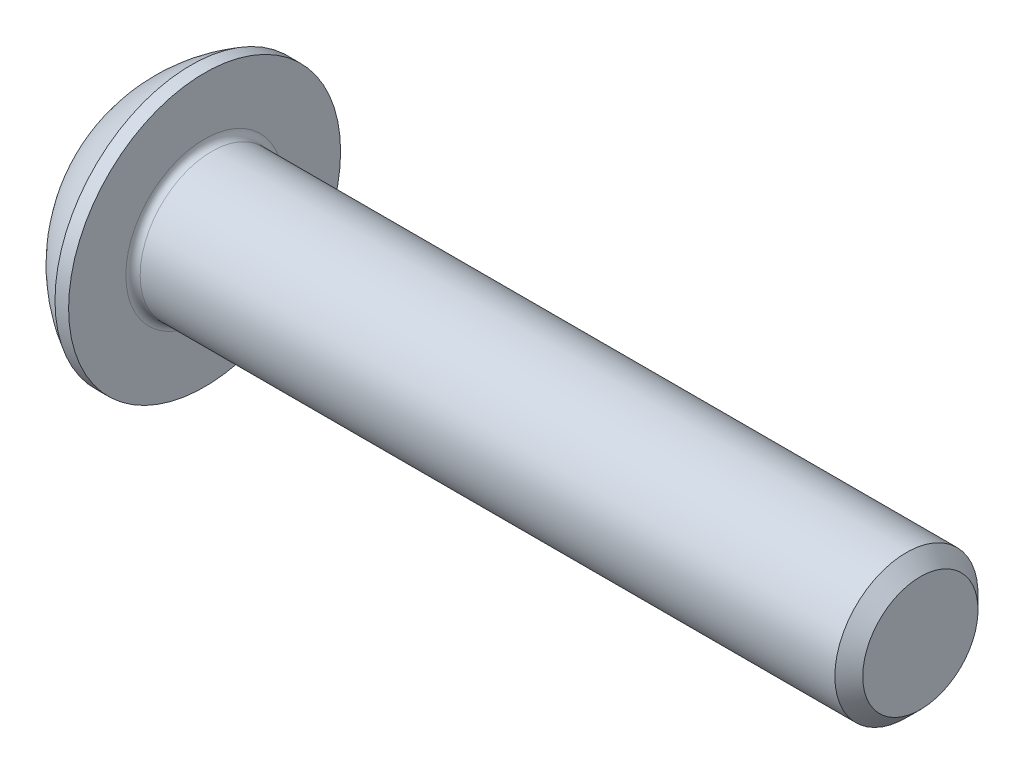
ISO-10303-21;
HEADER;
FILE_DESCRIPTION(('STEP AP214'),'2;1');
FILE_NAME('part.step','',(''),(''),'','','');
FILE_SCHEMA(('AUTOMOTIVE_DESIGN { 1 0 10303 214 1 1 1 1 }'));
ENDSEC;
DATA;
#1=APPLICATION_CONTEXT('core data for automotive mechanical design processes');
#2=APPLICATION_PROTOCOL_DEFINITION('international standard','automotive_design',2000,#1);
#3=PRODUCT_CONTEXT('',#1,'mechanical');
#4=PRODUCT('Part','Part','',(#3));
#5=PRODUCT_RELATED_PRODUCT_CATEGORY('part','',(#4));
#6=PRODUCT_DEFINITION_FORMATION('','',#4);
#7=PRODUCT_DEFINITION_CONTEXT('part definition',#1,'design');
#8=PRODUCT_DEFINITION('design','',#6,#7);
#9=PRODUCT_DEFINITION_SHAPE('','',#8);
#10=(LENGTH_UNIT() NAMED_UNIT(*) SI_UNIT(.MILLI.,.METRE.));
#11=(NAMED_UNIT(*) PLANE_ANGLE_UNIT() SI_UNIT($,.RADIAN.));
#12=(NAMED_UNIT(*) SI_UNIT($,.STERADIAN.) SOLID_ANGLE_UNIT());
#13=UNCERTAINTY_MEASURE_WITH_UNIT(LENGTH_MEASURE(1.E-05),#10,'distance_accuracy_value','');
#14=(GEOMETRIC_REPRESENTATION_CONTEXT(3) GLOBAL_UNCERTAINTY_ASSIGNED_CONTEXT((#13)) GLOBAL_UNIT_ASSIGNED_CONTEXT((#10,
#11,#12)) REPRESENTATION_CONTEXT('',''));
#15=CARTESIAN_POINT('',(0.,0.,0.));
#16=DIRECTION('',(0.,0.,1.));
#17=DIRECTION('',(1.,0.,0.));
#18=AXIS2_PLACEMENT_3D('',#15,#16,#17);
#19=CARTESIAN_POINT('',(0.,0.,0.));
#20=DIRECTION('',(-1.,0.,0.));
#21=DIRECTION('',(0.,0.,1.));
#22=AXIS2_PLACEMENT_3D('',#19,#20,#21);
#23=PLANE('',#22);
#24=CARTESIAN_POINT('',(0.,0.,0.));
#25=DIRECTION('',(-1.,0.,0.));
#26=DIRECTION('',(0.,0.,1.));
#27=AXIS2_PLACEMENT_3D('',#24,#25,#26);
#28=CIRCLE('',#27,1.9);
#29=CARTESIAN_POINT('',(0.,0.,1.9));
#30=VERTEX_POINT('',#29);
#31=EDGE_CURVE('E152',#30,#30,#28,.T.);
#32=ORIENTED_EDGE('',*,*,#31,.T.);
#33=EDGE_LOOP('',(#32));
#34=FACE_BOUND('',#33,.T.);
#35=DIRECTION('',(0.,-1.,0.));
#36=VECTOR('',#35,1.);
#37=CARTESIAN_POINT('',(0.,-0.721687836487031,1.25));
#38=LINE('',#37,#36);
#39=CARTESIAN_POINT('',(0.,0.721687836487033,1.25));
#40=VERTEX_POINT('',#39);
#41=CARTESIAN_POINT('',(0.,-0.721687836487031,1.25));
#42=VERTEX_POINT('',#41);
#43=EDGE_CURVE('E47',#40,#42,#38,.T.);
#44=ORIENTED_EDGE('',*,*,#43,.T.);
#45=DIRECTION('',(0.,-0.5,-0.866025403784439));
#46=VECTOR('',#45,1.);
#47=CARTESIAN_POINT('',(0.,-1.44337567297406,0.));
#48=LINE('',#47,#46);
#49=CARTESIAN_POINT('',(0.,-1.44337567297406,0.));
#50=VERTEX_POINT('',#49);
#51=EDGE_CURVE('E272',#42,#50,#48,.T.);
#52=ORIENTED_EDGE('',*,*,#51,.T.);
#53=DIRECTION('',(0.,0.5,-0.866025403784439));
#54=VECTOR('',#53,1.);
#55=CARTESIAN_POINT('',(0.,-0.721687836487031,-1.25));
#56=LINE('',#55,#54);
#57=CARTESIAN_POINT('',(0.,-0.721687836487031,-1.25));
#58=VERTEX_POINT('',#57);
#59=EDGE_CURVE('E127',#50,#58,#56,.T.);
#60=ORIENTED_EDGE('',*,*,#59,.T.);
#61=DIRECTION('',(0.,1.,0.));
#62=VECTOR('',#61,1.);
#63=CARTESIAN_POINT('',(0.,0.721687836487033,-1.25));
#64=LINE('',#63,#62);
#65=CARTESIAN_POINT('',(0.,0.721687836487033,-1.25));
#66=VERTEX_POINT('',#65);
#67=EDGE_CURVE('E275',#58,#66,#64,.T.);
#68=ORIENTED_EDGE('',*,*,#67,.T.);
#69=DIRECTION('',(0.,0.5,0.866025403784439));
#70=VECTOR('',#69,1.);
#71=CARTESIAN_POINT('',(0.,1.44337567297406,0.));
#72=LINE('',#71,#70);
#73=CARTESIAN_POINT('',(0.,1.44337567297406,0.));
#74=VERTEX_POINT('',#73);
#75=EDGE_CURVE('E277',#66,#74,#72,.T.);
#76=ORIENTED_EDGE('',*,*,#75,.T.);
#77=DIRECTION('',(0.,-0.5,0.866025403784439));
#78=VECTOR('',#77,1.);
#79=CARTESIAN_POINT('',(0.,0.721687836487033,1.25));
#80=LINE('',#79,#78);
#81=EDGE_CURVE('E279',#74,#40,#80,.T.);
#82=ORIENTED_EDGE('',*,*,#81,.T.);
#83=EDGE_LOOP('',(#44,#52,#60,#68,#76,#82));
#84=FACE_BOUND('',#83,.T.);
#85=ADVANCED_FACE('F32',(#34,#84),#23,.T.);
#86=CARTESIAN_POINT('',(3.88527472527473,0.,0.));
#87=DIRECTION('',(-1.,0.,0.));
#88=DIRECTION('',(0.,1.,0.));
#89=AXIS2_PLACEMENT_3D('',#86,#87,#88);
#90=SPHERICAL_SURFACE('',#89,4.3249693283142);
#91=CARTESIAN_POINT('',(1.82,0.,0.));
#92=DIRECTION('',(-1.,0.,0.));
#93=DIRECTION('',(0.,0.,1.));
#94=AXIS2_PLACEMENT_3D('',#91,#92,#93);
#95=CIRCLE('',#94,3.8);
#96=CARTESIAN_POINT('',(1.82,0.,3.8));
#97=VERTEX_POINT('',#96);
#98=EDGE_CURVE('E149',#97,#97,#95,.T.);
#99=ORIENTED_EDGE('',*,*,#98,.T.);
#100=EDGE_LOOP('',(#99));
#101=FACE_BOUND('',#100,.T.);
#102=ORIENTED_EDGE('',*,*,#31,.F.);
#103=EDGE_LOOP('',(#102));
#104=FACE_BOUND('',#103,.T.);
#105=ADVANCED_FACE('F173',(#101,#104),#90,.T.);
#106=CARTESIAN_POINT('',(0.,0.,0.));
#107=DIRECTION('',(-1.,0.,0.));
#108=DIRECTION('',(0.,0.,1.));
#109=AXIS2_PLACEMENT_3D('',#106,#107,#108);
#110=CYLINDRICAL_SURFACE('',#109,3.8);
#111=ORIENTED_EDGE('',*,*,#98,.F.);
#112=EDGE_LOOP('',(#111));
#113=FACE_BOUND('',#112,.T.);
#114=CARTESIAN_POINT('',(2.2,0.,0.));
#115=DIRECTION('',(-1.,0.,0.));
#116=DIRECTION('',(0.,0.,1.));
#117=AXIS2_PLACEMENT_3D('',#114,#115,#116);
#118=CIRCLE('',#117,3.8);
#119=CARTESIAN_POINT('',(2.2,0.,3.8));
#120=VERTEX_POINT('',#119);
#121=EDGE_CURVE('E146',#120,#120,#118,.T.);
#122=ORIENTED_EDGE('',*,*,#121,.T.);
#123=EDGE_LOOP('',(#122));
#124=FACE_BOUND('',#123,.T.);
#125=ADVANCED_FACE('F178',(#113,#124),#110,.T.);
#126=CARTESIAN_POINT('',(2.2,2.,0.));
#127=DIRECTION('',(-1.,0.,0.));
#128=DIRECTION('',(0.,0.,1.));
#129=AXIS2_PLACEMENT_3D('',#126,#127,#128);
#130=PLANE('',#129);
#131=CARTESIAN_POINT('',(2.2,0.,0.));
#132=DIRECTION('',(-1.,0.,0.));
#133=DIRECTION('',(0.,0.,1.));
#134=AXIS2_PLACEMENT_3D('',#131,#132,#133);
#135=CIRCLE('',#134,2.2);
#136=CARTESIAN_POINT('',(2.2,0.,2.2));
#137=VERTEX_POINT('',#136);
#138=EDGE_CURVE('E40',#137,#137,#135,.T.);
#139=ORIENTED_EDGE('',*,*,#138,.T.);
#140=EDGE_LOOP('',(#139));
#141=FACE_BOUND('',#140,.T.);
#142=ORIENTED_EDGE('',*,*,#121,.F.);
#143=EDGE_LOOP('',(#142));
#144=FACE_BOUND('',#143,.T.);
#145=ADVANCED_FACE('F157',(#141,#144),#130,.F.);
#146=CARTESIAN_POINT('',(0.,0.,0.));
#147=DIRECTION('',(-1.,0.,0.));
#148=DIRECTION('',(0.,0.,1.));
#149=AXIS2_PLACEMENT_3D('',#146,#147,#148);
#150=CYLINDRICAL_SURFACE('',#149,2.);
#151=CARTESIAN_POINT('',(2.4,0.,0.));
#152=DIRECTION('',(-1.,0.,0.));
#153=DIRECTION('',(0.,0.,1.));
#154=AXIS2_PLACEMENT_3D('',#151,#152,#153);
#155=CIRCLE('',#154,2.);
#156=CARTESIAN_POINT('',(2.4,0.,2.));
#157=VERTEX_POINT('',#156);
#158=EDGE_CURVE('E11',#157,#157,#155,.F.);
#159=ORIENTED_EDGE('',*,*,#158,.T.);
#160=EDGE_LOOP('',(#159));
#161=FACE_BOUND('',#160,.T.);
#162=CARTESIAN_POINT('',(21.81,0.,0.));
#163=DIRECTION('',(-1.,0.,0.));
#164=DIRECTION('',(0.,0.,1.));
#165=AXIS2_PLACEMENT_3D('',#162,#163,#164);
#166=CIRCLE('',#165,2.);
#167=CARTESIAN_POINT('',(21.81,0.,2.));
#168=VERTEX_POINT('',#167);
#169=EDGE_CURVE('E143',#168,#168,#166,.T.);
#170=ORIENTED_EDGE('',*,*,#169,.T.);
#171=EDGE_LOOP('',(#170));
#172=FACE_BOUND('',#171,.T.);
#173=ADVANCED_FACE('F187',(#161,#172),#150,.T.);
#174=CARTESIAN_POINT('',(22.2,0.,0.));
#175=DIRECTION('',(-1.,0.,0.));
#176=DIRECTION('',(0.,0.,1.));
#177=AXIS2_PLACEMENT_3D('',#174,#175,#176);
#178=CONICAL_SURFACE('',#177,1.61,0.785398163397443);
#179=ORIENTED_EDGE('',*,*,#169,.F.);
#180=EDGE_LOOP('',(#179));
#181=FACE_BOUND('',#180,.T.);
#182=CARTESIAN_POINT('',(22.2,0.,0.));
#183=DIRECTION('',(-1.,0.,0.));
#184=DIRECTION('',(0.,0.,1.));
#185=AXIS2_PLACEMENT_3D('',#182,#183,#184);
#186=CIRCLE('',#185,1.61);
#187=CARTESIAN_POINT('',(22.2,0.,1.61));
#188=VERTEX_POINT('',#187);
#189=EDGE_CURVE('E139',#188,#188,#186,.T.);
#190=ORIENTED_EDGE('',*,*,#189,.T.);
#191=EDGE_LOOP('',(#190));
#192=FACE_BOUND('',#191,.T.);
#193=ADVANCED_FACE('F168',(#181,#192),#178,.T.);
#194=CARTESIAN_POINT('',(22.2,0.,0.));
#195=DIRECTION('',(-1.,0.,0.));
#196=DIRECTION('',(0.,0.,1.));
#197=AXIS2_PLACEMENT_3D('',#194,#195,#196);
#198=PLANE('',#197);
#199=ORIENTED_EDGE('',*,*,#189,.F.);
#200=EDGE_LOOP('',(#199));
#201=FACE_BOUND('',#200,.T.);
#202=ADVANCED_FACE('F161',(#201),#198,.F.);
#203=CARTESIAN_POINT('',(2.4,0.,0.));
#204=DIRECTION('',(-1.,0.,0.));
#205=DIRECTION('',(0.,0.,1.));
#206=AXIS2_PLACEMENT_3D('',#203,#204,#205);
#207=TOROIDAL_SURFACE('',#206,2.2,0.2);
#208=ORIENTED_EDGE('',*,*,#158,.F.);
#209=EDGE_LOOP('',(#208));
#210=FACE_BOUND('',#209,.T.);
#211=ORIENTED_EDGE('',*,*,#138,.F.);
#212=EDGE_LOOP('',(#211));
#213=FACE_BOUND('',#212,.T.);
#214=ADVANCED_FACE('F34',(#210,#213),#207,.F.);
#215=CARTESIAN_POINT('',(1.3,-1.44337567297406,0.));
#216=DIRECTION('',(0.,0.866025403784439,-0.5));
#217=DIRECTION('',(0.,0.5,0.866025403784439));
#218=AXIS2_PLACEMENT_3D('',#215,#216,#217);
#219=PLANE('',#218);
#220=DIRECTION('',(0.,-0.5,-0.866025403784439));
#221=VECTOR('',#220,1.);
#222=CARTESIAN_POINT('',(1.3,-1.44337567297406,0.));
#223=LINE('',#222,#221);
#224=CARTESIAN_POINT('',(1.3,-0.721687836487031,1.25));
#225=VERTEX_POINT('',#224);
#226=CARTESIAN_POINT('',(1.3,-1.08253175473055,0.625));
#227=VERTEX_POINT('',#226);
#228=EDGE_CURVE('E113',#225,#227,#223,.T.);
#229=ORIENTED_EDGE('',*,*,#228,.T.);
#230=CARTESIAN_POINT('',(1.3,-1.44337567297406,0.));
#231=VERTEX_POINT('',#230);
#232=EDGE_CURVE('E108',#227,#231,#223,.T.);
#233=ORIENTED_EDGE('',*,*,#232,.T.);
#234=DIRECTION('',(-1.,0.,0.));
#235=VECTOR('',#234,1.);
#236=CARTESIAN_POINT('',(1.3,-1.44337567297406,0.));
#237=LINE('',#236,#235);
#238=EDGE_CURVE('E110',#231,#50,#237,.T.);
#239=ORIENTED_EDGE('',*,*,#238,.T.);
#240=ORIENTED_EDGE('',*,*,#51,.F.);
#241=DIRECTION('',(-1.,0.,0.));
#242=VECTOR('',#241,1.);
#243=CARTESIAN_POINT('',(1.3,-0.721687836487031,1.25));
#244=LINE('',#243,#242);
#245=EDGE_CURVE('E268',#225,#42,#244,.T.);
#246=ORIENTED_EDGE('',*,*,#245,.F.);
#247=EDGE_LOOP('',(#229,#233,#239,#240,#246));
#248=FACE_BOUND('',#247,.T.);
#249=ADVANCED_FACE('F109',(#248),#219,.T.);
#250=CARTESIAN_POINT('',(1.3,-0.721687836487031,-1.25));
#251=DIRECTION('',(0.,0.866025403784439,0.5));
#252=DIRECTION('',(0.,-0.5,0.866025403784439));
#253=AXIS2_PLACEMENT_3D('',#250,#251,#252);
#254=PLANE('',#253);
#255=DIRECTION('',(0.,0.5,-0.866025403784439));
#256=VECTOR('',#255,1.);
#257=CARTESIAN_POINT('',(1.3,-0.721687836487031,-1.25));
#258=LINE('',#257,#256);
#259=CARTESIAN_POINT('',(1.3,-1.08253175473055,-0.625));
#260=VERTEX_POINT('',#259);
#261=EDGE_CURVE('E55',#231,#260,#258,.T.);
#262=ORIENTED_EDGE('',*,*,#261,.T.);
#263=CARTESIAN_POINT('',(1.3,-0.721687836487031,-1.25));
#264=VERTEX_POINT('',#263);
#265=EDGE_CURVE('E122',#260,#264,#258,.T.);
#266=ORIENTED_EDGE('',*,*,#265,.T.);
#267=DIRECTION('',(-1.,0.,0.));
#268=VECTOR('',#267,1.);
#269=CARTESIAN_POINT('',(1.3,-0.721687836487031,-1.25));
#270=LINE('',#269,#268);
#271=EDGE_CURVE('E129',#264,#58,#270,.T.);
#272=ORIENTED_EDGE('',*,*,#271,.T.);
#273=ORIENTED_EDGE('',*,*,#59,.F.);
#274=ORIENTED_EDGE('',*,*,#238,.F.);
#275=EDGE_LOOP('',(#262,#266,#272,#273,#274));
#276=FACE_BOUND('',#275,.T.);
#277=ADVANCED_FACE('F125',(#276),#254,.T.);
#278=CARTESIAN_POINT('',(1.3,0.721687836487033,-1.25));
#279=DIRECTION('',(0.,0.,1.));
#280=DIRECTION('',(1.,0.,0.));
#281=AXIS2_PLACEMENT_3D('',#278,#279,#280);
#282=PLANE('',#281);
#283=DIRECTION('',(0.,1.,0.));
#284=VECTOR('',#283,1.);
#285=CARTESIAN_POINT('',(1.3,0.721687836487033,-1.25));
#286=LINE('',#285,#284);
#287=CARTESIAN_POINT('',(1.3,0.,-1.25));
#288=VERTEX_POINT('',#287);
#289=EDGE_CURVE('E249',#264,#288,#286,.T.);
#290=ORIENTED_EDGE('',*,*,#289,.T.);
#291=CARTESIAN_POINT('',(1.3,0.721687836487033,-1.25));
#292=VERTEX_POINT('',#291);
#293=EDGE_CURVE('E121',#288,#292,#286,.T.);
#294=ORIENTED_EDGE('',*,*,#293,.T.);
#295=DIRECTION('',(-1.,0.,0.));
#296=VECTOR('',#295,1.);
#297=CARTESIAN_POINT('',(1.3,0.721687836487033,-1.25));
#298=LINE('',#297,#296);
#299=EDGE_CURVE('E134',#292,#66,#298,.T.);
#300=ORIENTED_EDGE('',*,*,#299,.T.);
#301=ORIENTED_EDGE('',*,*,#67,.F.);
#302=ORIENTED_EDGE('',*,*,#271,.F.);
#303=EDGE_LOOP('',(#290,#294,#300,#301,#302));
#304=FACE_BOUND('',#303,.T.);
#305=ADVANCED_FACE('F201',(#304),#282,.T.);
#306=CARTESIAN_POINT('',(1.3,1.44337567297406,0.));
#307=DIRECTION('',(0.,-0.866025403784439,0.5));
#308=DIRECTION('',(0.,-0.5,-0.866025403784439));
#309=AXIS2_PLACEMENT_3D('',#306,#307,#308);
#310=PLANE('',#309);
#311=DIRECTION('',(0.,0.5,0.866025403784439));
#312=VECTOR('',#311,1.);
#313=CARTESIAN_POINT('',(1.3,1.44337567297406,0.));
#314=LINE('',#313,#312);
#315=CARTESIAN_POINT('',(1.3,1.08253175473055,-0.625));
#316=VERTEX_POINT('',#315);
#317=EDGE_CURVE('E238',#292,#316,#314,.T.);
#318=ORIENTED_EDGE('',*,*,#317,.T.);
#319=CARTESIAN_POINT('',(1.3,1.44337567297406,0.));
#320=VERTEX_POINT('',#319);
#321=EDGE_CURVE('E243',#316,#320,#314,.T.);
#322=ORIENTED_EDGE('',*,*,#321,.T.);
#323=DIRECTION('',(-1.,0.,0.));
#324=VECTOR('',#323,1.);
#325=CARTESIAN_POINT('',(1.3,1.44337567297406,0.));
#326=LINE('',#325,#324);
#327=EDGE_CURVE('E283',#320,#74,#326,.T.);
#328=ORIENTED_EDGE('',*,*,#327,.T.);
#329=ORIENTED_EDGE('',*,*,#75,.F.);
#330=ORIENTED_EDGE('',*,*,#299,.F.);
#331=EDGE_LOOP('',(#318,#322,#328,#329,#330));
#332=FACE_BOUND('',#331,.T.);
#333=ADVANCED_FACE('F204',(#332),#310,.T.);
#334=CARTESIAN_POINT('',(1.3,0.721687836487033,1.25));
#335=DIRECTION('',(0.,-0.866025403784439,-0.5));
#336=DIRECTION('',(0.,0.5,-0.866025403784439));
#337=AXIS2_PLACEMENT_3D('',#334,#335,#336);
#338=PLANE('',#337);
#339=DIRECTION('',(0.,-0.5,0.866025403784439));
#340=VECTOR('',#339,1.);
#341=CARTESIAN_POINT('',(1.3,0.721687836487033,1.25));
#342=LINE('',#341,#340);
#343=CARTESIAN_POINT('',(1.3,1.08253175473055,0.625));
#344=VERTEX_POINT('',#343);
#345=EDGE_CURVE('E246',#320,#344,#342,.T.);
#346=ORIENTED_EDGE('',*,*,#345,.T.);
#347=CARTESIAN_POINT('',(1.3,0.721687836487033,1.25));
#348=VERTEX_POINT('',#347);
#349=EDGE_CURVE('E254',#344,#348,#342,.T.);
#350=ORIENTED_EDGE('',*,*,#349,.T.);
#351=DIRECTION('',(-1.,0.,0.));
#352=VECTOR('',#351,1.);
#353=CARTESIAN_POINT('',(1.3,0.721687836487033,1.25));
#354=LINE('',#353,#352);
#355=EDGE_CURVE('E267',#348,#40,#354,.T.);
#356=ORIENTED_EDGE('',*,*,#355,.T.);
#357=ORIENTED_EDGE('',*,*,#81,.F.);
#358=ORIENTED_EDGE('',*,*,#327,.F.);
#359=EDGE_LOOP('',(#346,#350,#356,#357,#358));
#360=FACE_BOUND('',#359,.T.);
#361=ADVANCED_FACE('F208',(#360),#338,.T.);
#362=CARTESIAN_POINT('',(1.3,-0.721687836487031,1.25));
#363=DIRECTION('',(0.,0.,-1.));
#364=DIRECTION('',(-1.,0.,0.));
#365=AXIS2_PLACEMENT_3D('',#362,#363,#364);
#366=PLANE('',#365);
#367=DIRECTION('',(0.,-1.,0.));
#368=VECTOR('',#367,1.);
#369=CARTESIAN_POINT('',(1.3,-0.721687836487031,1.25));
#370=LINE('',#369,#368);
#371=CARTESIAN_POINT('',(1.3,0.,1.25));
#372=VERTEX_POINT('',#371);
#373=EDGE_CURVE('E260',#348,#372,#370,.T.);
#374=ORIENTED_EDGE('',*,*,#373,.T.);
#375=EDGE_CURVE('E262',#372,#225,#370,.T.);
#376=ORIENTED_EDGE('',*,*,#375,.T.);
#377=ORIENTED_EDGE('',*,*,#245,.T.);
#378=ORIENTED_EDGE('',*,*,#43,.F.);
#379=ORIENTED_EDGE('',*,*,#355,.F.);
#380=EDGE_LOOP('',(#374,#376,#377,#378,#379));
#381=FACE_BOUND('',#380,.T.);
#382=ADVANCED_FACE('F212',(#381),#366,.T.);
#383=CARTESIAN_POINT('',(1.3,-1.44337567297406,0.));
#384=DIRECTION('',(1.,0.,0.));
#385=DIRECTION('',(0.,0.,-1.));
#386=AXIS2_PLACEMENT_3D('',#383,#384,#385);
#387=PLANE('',#386);
#388=CARTESIAN_POINT('',(1.3,0.,0.));
#389=DIRECTION('',(-1.,0.,0.));
#390=DIRECTION('',(0.,0.,1.));
#391=AXIS2_PLACEMENT_3D('',#388,#389,#390);
#392=CIRCLE('',#391,1.25);
#393=EDGE_CURVE('E235',#316,#288,#392,.T.);
#394=ORIENTED_EDGE('',*,*,#393,.F.);
#395=ORIENTED_EDGE('',*,*,#317,.F.);
#396=ORIENTED_EDGE('',*,*,#293,.F.);
#397=EDGE_LOOP('',(#394,#395,#396));
#398=FACE_BOUND('',#397,.T.);
#399=ADVANCED_FACE('F216',(#398),#387,.F.);
#400=EDGE_CURVE('E140',#344,#316,#392,.T.);
#401=ORIENTED_EDGE('',*,*,#400,.F.);
#402=ORIENTED_EDGE('',*,*,#345,.F.);
#403=ORIENTED_EDGE('',*,*,#321,.F.);
#404=EDGE_LOOP('',(#401,#402,#403));
#405=FACE_BOUND('',#404,.T.);
#406=ADVANCED_FACE('F225',(#405),#387,.F.);
#407=EDGE_CURVE('E133',#372,#344,#392,.T.);
#408=ORIENTED_EDGE('',*,*,#407,.F.);
#409=ORIENTED_EDGE('',*,*,#373,.F.);
#410=ORIENTED_EDGE('',*,*,#349,.F.);
#411=EDGE_LOOP('',(#408,#409,#410));
#412=FACE_BOUND('',#411,.T.);
#413=ADVANCED_FACE('F230',(#412),#387,.F.);
#414=EDGE_CURVE('E128',#227,#372,#392,.T.);
#415=ORIENTED_EDGE('',*,*,#414,.F.);
#416=ORIENTED_EDGE('',*,*,#228,.F.);
#417=ORIENTED_EDGE('',*,*,#375,.F.);
#418=EDGE_LOOP('',(#415,#416,#417));
#419=FACE_BOUND('',#418,.T.);
#420=ADVANCED_FACE('F223',(#419),#387,.F.);
#421=EDGE_CURVE('E119',#260,#227,#392,.T.);
#422=ORIENTED_EDGE('',*,*,#421,.F.);
#423=ORIENTED_EDGE('',*,*,#261,.F.);
#424=ORIENTED_EDGE('',*,*,#232,.F.);
#425=EDGE_LOOP('',(#422,#423,#424));
#426=FACE_BOUND('',#425,.T.);
#427=ADVANCED_FACE('F118',(#426),#387,.F.);
#428=EDGE_CURVE('E241',#288,#260,#392,.T.);
#429=ORIENTED_EDGE('',*,*,#428,.F.);
#430=ORIENTED_EDGE('',*,*,#289,.F.);
#431=ORIENTED_EDGE('',*,*,#265,.F.);
#432=EDGE_LOOP('',(#429,#430,#431));
#433=FACE_BOUND('',#432,.T.);
#434=ADVANCED_FACE('F196',(#433),#387,.F.);
#435=CARTESIAN_POINT('',(2.02168783648704,0.,0.));
#436=DIRECTION('',(-1.,0.,0.));
#437=DIRECTION('',(0.,0.,1.));
#438=AXIS2_PLACEMENT_3D('',#435,#436,#437);
#439=CONICAL_SURFACE('',#438,0.,1.04719755119659);
#440=ORIENTED_EDGE('',*,*,#407,.T.);
#441=ORIENTED_EDGE('',*,*,#400,.T.);
#442=ORIENTED_EDGE('',*,*,#393,.T.);
#443=ORIENTED_EDGE('',*,*,#428,.T.);
#444=ORIENTED_EDGE('',*,*,#421,.T.);
#445=ORIENTED_EDGE('',*,*,#414,.T.);
#446=EDGE_LOOP('',(#440,#441,#442,#443,#444,#445));
#447=FACE_BOUND('',#446,.T.);
#448=CARTESIAN_POINT('',(2.02168783648704,0.,0.));
#449=VERTEX_POINT('',#448);
#450=VERTEX_LOOP('',#449);
#451=FACE_BOUND('',#450,.T.);
#452=ADVANCED_FACE('F194',(#447,#451),#439,.F.);
#453=CLOSED_SHELL('',(#85,#105,#125,#145,#173,#193,#202,#214,#249,#277,#305,#333,#361,#382,#399,
#406,#413,#420,#427,#434,#452));
#454=MANIFOLD_SOLID_BREP('B2',#453);
#455=ADVANCED_BREP_SHAPE_REPRESENTATION('',(#18,#454),#14);
#456=SHAPE_DEFINITION_REPRESENTATION(#9,#455);
ENDSEC;
END-ISO-10303-21;
